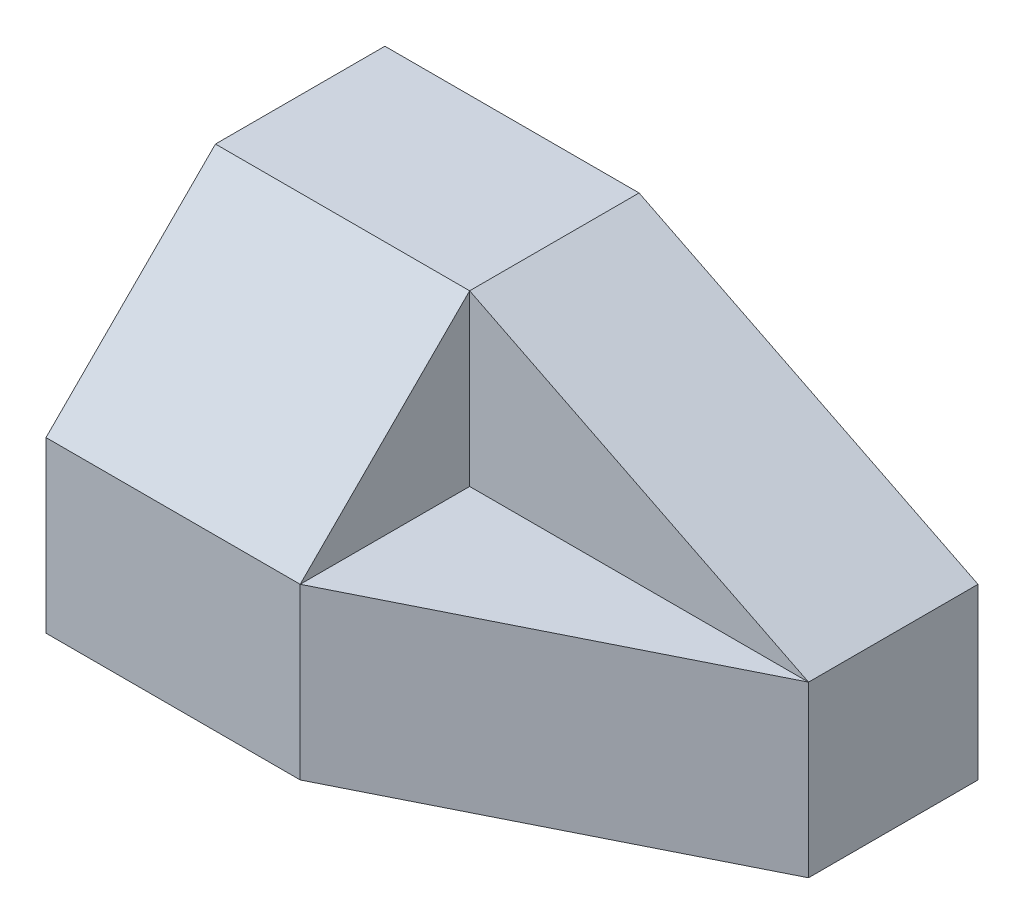
ISO-10303-21;
HEADER;
FILE_DESCRIPTION(('STEP AP214'),'2;1');
FILE_NAME('part.step','',(''),(''),'','','');
FILE_SCHEMA(('AUTOMOTIVE_DESIGN { 1 0 10303 214 1 1 1 1 }'));
ENDSEC;
DATA;
#1=APPLICATION_CONTEXT('core data for automotive mechanical design processes');
#2=APPLICATION_PROTOCOL_DEFINITION('international standard','automotive_design',2000,#1);
#3=PRODUCT_CONTEXT('',#1,'mechanical');
#4=PRODUCT('Part','Part','',(#3));
#5=PRODUCT_RELATED_PRODUCT_CATEGORY('part','',(#4));
#6=PRODUCT_DEFINITION_FORMATION('','',#4);
#7=PRODUCT_DEFINITION_CONTEXT('part definition',#1,'design');
#8=PRODUCT_DEFINITION('design','',#6,#7);
#9=PRODUCT_DEFINITION_SHAPE('','',#8);
#10=(LENGTH_UNIT() NAMED_UNIT(*) SI_UNIT(.MILLI.,.METRE.));
#11=(NAMED_UNIT(*) PLANE_ANGLE_UNIT() SI_UNIT($,.RADIAN.));
#12=(NAMED_UNIT(*) SI_UNIT($,.STERADIAN.) SOLID_ANGLE_UNIT());
#13=UNCERTAINTY_MEASURE_WITH_UNIT(LENGTH_MEASURE(1.E-05),#10,'distance_accuracy_value','');
#14=(GEOMETRIC_REPRESENTATION_CONTEXT(3) GLOBAL_UNCERTAINTY_ASSIGNED_CONTEXT((#13)) GLOBAL_UNIT_ASSIGNED_CONTEXT((#10,
#11,#12)) REPRESENTATION_CONTEXT('',''));
#15=CARTESIAN_POINT('',(0.,0.,0.));
#16=DIRECTION('',(0.,0.,1.));
#17=DIRECTION('',(1.,0.,0.));
#18=AXIS2_PLACEMENT_3D('',#15,#16,#17);
#19=CARTESIAN_POINT('',(177.8,101.6,0.));
#20=DIRECTION('',(-1.,0.,0.));
#21=DIRECTION('',(0.,0.,1.));
#22=AXIS2_PLACEMENT_3D('',#19,#20,#21);
#23=PLANE('',#22);
#24=DIRECTION('',(0.,-1.,0.));
#25=VECTOR('',#24,1.);
#26=CARTESIAN_POINT('',(177.8,101.6,-101.6));
#27=LINE('',#26,#25);
#28=CARTESIAN_POINT('',(177.8,50.8,-101.6));
#29=VERTEX_POINT('',#28);
#30=CARTESIAN_POINT('',(177.8,0.,-101.6));
#31=VERTEX_POINT('',#30);
#32=EDGE_CURVE('E41',#29,#31,#27,.T.);
#33=ORIENTED_EDGE('',*,*,#32,.F.);
#34=DIRECTION('',(0.,0.,1.));
#35=VECTOR('',#34,1.);
#36=CARTESIAN_POINT('',(177.8,50.8,-101.6));
#37=LINE('',#36,#35);
#38=CARTESIAN_POINT('',(177.8,50.8,-50.8));
#39=VERTEX_POINT('',#38);
#40=EDGE_CURVE('E143',#29,#39,#37,.T.);
#41=ORIENTED_EDGE('',*,*,#40,.T.);
#42=DIRECTION('',(0.,-1.,0.));
#43=VECTOR('',#42,1.);
#44=CARTESIAN_POINT('',(177.8,50.8,-50.8));
#45=LINE('',#44,#43);
#46=CARTESIAN_POINT('',(177.8,0.,-50.8));
#47=VERTEX_POINT('',#46);
#48=EDGE_CURVE('E87',#39,#47,#45,.T.);
#49=ORIENTED_EDGE('',*,*,#48,.T.);
#50=DIRECTION('',(0.,0.,-1.));
#51=VECTOR('',#50,1.);
#52=CARTESIAN_POINT('',(177.8,0.,0.));
#53=LINE('',#52,#51);
#54=EDGE_CURVE('E84',#47,#31,#53,.T.);
#55=ORIENTED_EDGE('',*,*,#54,.T.);
#56=EDGE_LOOP('',(#33,#41,#49,#55));
#57=FACE_BOUND('',#56,.T.);
#58=ADVANCED_FACE('F33',(#57),#23,.F.);
#59=CARTESIAN_POINT('',(0.,101.6,0.));
#60=DIRECTION('',(0.,-1.,0.));
#61=DIRECTION('',(0.,0.,-1.));
#62=AXIS2_PLACEMENT_3D('',#59,#60,#61);
#63=PLANE('',#62);
#64=DIRECTION('',(1.,0.,0.));
#65=VECTOR('',#64,1.);
#66=CARTESIAN_POINT('',(-285.75,101.6,-50.8));
#67=LINE('',#66,#65);
#68=CARTESIAN_POINT('',(0.,101.6,-50.8));
#69=VERTEX_POINT('',#68);
#70=CARTESIAN_POINT('',(76.2,101.6,-50.8));
#71=VERTEX_POINT('',#70);
#72=EDGE_CURVE('E106',#69,#71,#67,.T.);
#73=ORIENTED_EDGE('',*,*,#72,.T.);
#74=DIRECTION('',(0.,0.,1.));
#75=VECTOR('',#74,1.);
#76=CARTESIAN_POINT('',(76.2,101.6,-101.6));
#77=LINE('',#76,#75);
#78=CARTESIAN_POINT('',(76.2,101.6,-101.6));
#79=VERTEX_POINT('',#78);
#80=EDGE_CURVE('E141',#79,#71,#77,.T.);
#81=ORIENTED_EDGE('',*,*,#80,.F.);
#82=DIRECTION('',(-1.,0.,0.));
#83=VECTOR('',#82,1.);
#84=CARTESIAN_POINT('',(0.,101.6,-101.6));
#85=LINE('',#84,#83);
#86=CARTESIAN_POINT('',(0.,101.6,-101.6));
#87=VERTEX_POINT('',#86);
#88=EDGE_CURVE('E57',#79,#87,#85,.T.);
#89=ORIENTED_EDGE('',*,*,#88,.T.);
#90=DIRECTION('',(0.,0.,1.));
#91=VECTOR('',#90,1.);
#92=CARTESIAN_POINT('',(0.,101.6,0.));
#93=LINE('',#92,#91);
#94=EDGE_CURVE('E96',#87,#69,#93,.T.);
#95=ORIENTED_EDGE('',*,*,#94,.T.);
#96=EDGE_LOOP('',(#73,#81,#89,#95));
#97=FACE_BOUND('',#96,.T.);
#98=ADVANCED_FACE('F146',(#97),#63,.F.);
#99=CARTESIAN_POINT('',(0.,101.6,0.));
#100=DIRECTION('',(0.,0.,-1.));
#101=DIRECTION('',(-1.,0.,0.));
#102=AXIS2_PLACEMENT_3D('',#99,#100,#101);
#103=PLANE('',#102);
#104=DIRECTION('',(0.,-1.,0.));
#105=VECTOR('',#104,1.);
#106=CARTESIAN_POINT('',(76.2,50.8,0.));
#107=LINE('',#106,#105);
#108=CARTESIAN_POINT('',(76.2,50.8,0.));
#109=VERTEX_POINT('',#108);
#110=CARTESIAN_POINT('',(76.2,0.,0.));
#111=VERTEX_POINT('',#110);
#112=EDGE_CURVE('E48',#109,#111,#107,.T.);
#113=ORIENTED_EDGE('',*,*,#112,.F.);
#114=DIRECTION('',(1.,0.,0.));
#115=VECTOR('',#114,1.);
#116=CARTESIAN_POINT('',(-285.75,50.8,0.));
#117=LINE('',#116,#115);
#118=CARTESIAN_POINT('',(0.,50.8,0.));
#119=VERTEX_POINT('',#118);
#120=EDGE_CURVE('E168',#119,#109,#117,.T.);
#121=ORIENTED_EDGE('',*,*,#120,.F.);
#122=DIRECTION('',(0.,-1.,0.));
#123=VECTOR('',#122,1.);
#124=CARTESIAN_POINT('',(0.,101.6,0.));
#125=LINE('',#124,#123);
#126=CARTESIAN_POINT('',(0.,0.,0.));
#127=VERTEX_POINT('',#126);
#128=EDGE_CURVE('E11',#119,#127,#125,.T.);
#129=ORIENTED_EDGE('',*,*,#128,.T.);
#130=DIRECTION('',(1.,0.,0.));
#131=VECTOR('',#130,1.);
#132=CARTESIAN_POINT('',(0.,0.,0.));
#133=LINE('',#132,#131);
#134=EDGE_CURVE('E89',#127,#111,#133,.T.);
#135=ORIENTED_EDGE('',*,*,#134,.T.);
#136=EDGE_LOOP('',(#113,#121,#129,#135));
#137=FACE_BOUND('',#136,.T.);
#138=ADVANCED_FACE('F109',(#137),#103,.F.);
#139=CARTESIAN_POINT('',(0.,0.,0.));
#140=DIRECTION('',(0.,-1.,0.));
#141=DIRECTION('',(0.,0.,-1.));
#142=AXIS2_PLACEMENT_3D('',#139,#140,#141);
#143=PLANE('',#142);
#144=ORIENTED_EDGE('',*,*,#54,.F.);
#145=DIRECTION('',(-0.894427190999916,0.,0.447213595499958));
#146=VECTOR('',#145,1.);
#147=CARTESIAN_POINT('',(76.2,0.,0.));
#148=LINE('',#147,#146);
#149=EDGE_CURVE('E114',#47,#111,#148,.T.);
#150=ORIENTED_EDGE('',*,*,#149,.T.);
#151=ORIENTED_EDGE('',*,*,#134,.F.);
#152=DIRECTION('',(0.,0.,1.));
#153=VECTOR('',#152,1.);
#154=CARTESIAN_POINT('',(0.,0.,0.));
#155=LINE('',#154,#153);
#156=CARTESIAN_POINT('',(0.,0.,-101.6));
#157=VERTEX_POINT('',#156);
#158=EDGE_CURVE('E95',#157,#127,#155,.T.);
#159=ORIENTED_EDGE('',*,*,#158,.F.);
#160=DIRECTION('',(-1.,0.,0.));
#161=VECTOR('',#160,1.);
#162=CARTESIAN_POINT('',(0.,0.,-101.6));
#163=LINE('',#162,#161);
#164=EDGE_CURVE('E74',#31,#157,#163,.T.);
#165=ORIENTED_EDGE('',*,*,#164,.F.);
#166=EDGE_LOOP('',(#144,#150,#151,#159,#165));
#167=FACE_BOUND('',#166,.T.);
#168=ADVANCED_FACE('F92',(#167),#143,.T.);
#169=CARTESIAN_POINT('',(0.,101.6,0.));
#170=DIRECTION('',(1.,0.,0.));
#171=DIRECTION('',(0.,0.,-1.));
#172=AXIS2_PLACEMENT_3D('',#169,#170,#171);
#173=PLANE('',#172);
#174=ORIENTED_EDGE('',*,*,#128,.F.);
#175=DIRECTION('',(0.,-0.707106781186548,0.707106781186548));
#176=VECTOR('',#175,1.);
#177=CARTESIAN_POINT('',(0.,50.8,0.));
#178=LINE('',#177,#176);
#179=EDGE_CURVE('E118',#69,#119,#178,.T.);
#180=ORIENTED_EDGE('',*,*,#179,.F.);
#181=ORIENTED_EDGE('',*,*,#94,.F.);
#182=DIRECTION('',(0.,-1.,0.));
#183=VECTOR('',#182,1.);
#184=CARTESIAN_POINT('',(0.,101.6,-101.6));
#185=LINE('',#184,#183);
#186=EDGE_CURVE('E81',#87,#157,#185,.T.);
#187=ORIENTED_EDGE('',*,*,#186,.T.);
#188=ORIENTED_EDGE('',*,*,#158,.T.);
#189=EDGE_LOOP('',(#174,#180,#181,#187,#188));
#190=FACE_BOUND('',#189,.T.);
#191=ADVANCED_FACE('F35',(#190),#173,.F.);
#192=CARTESIAN_POINT('',(0.,101.6,-101.6));
#193=DIRECTION('',(0.,0.,1.));
#194=DIRECTION('',(1.,0.,0.));
#195=AXIS2_PLACEMENT_3D('',#192,#193,#194);
#196=PLANE('',#195);
#197=ORIENTED_EDGE('',*,*,#88,.F.);
#198=DIRECTION('',(0.894427190999916,-0.447213595499958,0.));
#199=VECTOR('',#198,1.);
#200=CARTESIAN_POINT('',(177.8,50.8,-101.6));
#201=LINE('',#200,#199);
#202=EDGE_CURVE('E78',#79,#29,#201,.T.);
#203=ORIENTED_EDGE('',*,*,#202,.T.);
#204=ORIENTED_EDGE('',*,*,#32,.T.);
#205=ORIENTED_EDGE('',*,*,#164,.T.);
#206=ORIENTED_EDGE('',*,*,#186,.F.);
#207=EDGE_LOOP('',(#197,#203,#204,#205,#206));
#208=FACE_BOUND('',#207,.T.);
#209=ADVANCED_FACE('F72',(#208),#196,.F.);
#210=CARTESIAN_POINT('',(-285.75,50.8,0.));
#211=DIRECTION('',(0.,-0.707106781186548,-0.707106781186548));
#212=DIRECTION('',(0.,0.707106781186548,-0.707106781186548));
#213=AXIS2_PLACEMENT_3D('',#210,#211,#212);
#214=PLANE('',#213);
#215=ORIENTED_EDGE('',*,*,#179,.T.);
#216=ORIENTED_EDGE('',*,*,#120,.T.);
#217=DIRECTION('',(0.,-0.707106781186548,0.707106781186548));
#218=VECTOR('',#217,1.);
#219=CARTESIAN_POINT('',(76.2,50.8,0.));
#220=LINE('',#219,#218);
#221=EDGE_CURVE('E165',#71,#109,#220,.T.);
#222=ORIENTED_EDGE('',*,*,#221,.F.);
#223=ORIENTED_EDGE('',*,*,#72,.F.);
#224=EDGE_LOOP('',(#215,#216,#222,#223));
#225=FACE_BOUND('',#224,.T.);
#226=ADVANCED_FACE('F170',(#225),#214,.F.);
#227=CARTESIAN_POINT('',(76.2,50.8,0.));
#228=DIRECTION('',(0.447213595499958,0.,0.894427190999916));
#229=DIRECTION('',(0.894427190999916,0.,-0.447213595499958));
#230=AXIS2_PLACEMENT_3D('',#227,#228,#229);
#231=PLANE('',#230);
#232=DIRECTION('',(0.894427190999916,0.,-0.447213595499958));
#233=VECTOR('',#232,1.);
#234=CARTESIAN_POINT('',(76.2,50.8,0.));
#235=LINE('',#234,#233);
#236=EDGE_CURVE('E148',#109,#39,#235,.T.);
#237=ORIENTED_EDGE('',*,*,#236,.F.);
#238=ORIENTED_EDGE('',*,*,#112,.T.);
#239=ORIENTED_EDGE('',*,*,#149,.F.);
#240=ORIENTED_EDGE('',*,*,#48,.F.);
#241=EDGE_LOOP('',(#237,#238,#239,#240));
#242=FACE_BOUND('',#241,.T.);
#243=ADVANCED_FACE('F174',(#242),#231,.T.);
#244=CARTESIAN_POINT('',(76.2,50.8,-50.8));
#245=DIRECTION('',(-1.,0.,0.));
#246=DIRECTION('',(0.,0.,1.));
#247=AXIS2_PLACEMENT_3D('',#244,#245,#246);
#248=PLANE('',#247);
#249=DIRECTION('',(0.,0.,1.));
#250=VECTOR('',#249,1.);
#251=CARTESIAN_POINT('',(76.2,50.8,-50.8));
#252=LINE('',#251,#250);
#253=CARTESIAN_POINT('',(76.2,50.8,-50.8));
#254=VERTEX_POINT('',#253);
#255=EDGE_CURVE('E157',#254,#109,#252,.T.);
#256=ORIENTED_EDGE('',*,*,#255,.F.);
#257=DIRECTION('',(0.,1.,0.));
#258=VECTOR('',#257,1.);
#259=CARTESIAN_POINT('',(76.2,50.8,-50.8));
#260=LINE('',#259,#258);
#261=EDGE_CURVE('E159',#254,#71,#260,.T.);
#262=ORIENTED_EDGE('',*,*,#261,.T.);
#263=ORIENTED_EDGE('',*,*,#221,.T.);
#264=EDGE_LOOP('',(#256,#262,#263));
#265=FACE_BOUND('',#264,.T.);
#266=ADVANCED_FACE('F173',(#265),#248,.F.);
#267=CARTESIAN_POINT('',(177.8,50.8,-50.8));
#268=DIRECTION('',(0.,0.,-1.));
#269=DIRECTION('',(-1.,0.,0.));
#270=AXIS2_PLACEMENT_3D('',#267,#268,#269);
#271=PLANE('',#270);
#272=DIRECTION('',(-1.,0.,0.));
#273=VECTOR('',#272,1.);
#274=CARTESIAN_POINT('',(177.8,50.8,-50.8));
#275=LINE('',#274,#273);
#276=EDGE_CURVE('E154',#39,#254,#275,.T.);
#277=ORIENTED_EDGE('',*,*,#276,.F.);
#278=DIRECTION('',(0.894427190999916,-0.447213595499958,0.));
#279=VECTOR('',#278,1.);
#280=CARTESIAN_POINT('',(177.8,50.8,-50.8));
#281=LINE('',#280,#279);
#282=EDGE_CURVE('E144',#71,#39,#281,.T.);
#283=ORIENTED_EDGE('',*,*,#282,.F.);
#284=ORIENTED_EDGE('',*,*,#261,.F.);
#285=EDGE_LOOP('',(#277,#283,#284));
#286=FACE_BOUND('',#285,.T.);
#287=ADVANCED_FACE('F179',(#286),#271,.F.);
#288=CARTESIAN_POINT('',(0.,50.8,0.));
#289=DIRECTION('',(0.,-1.,0.));
#290=DIRECTION('',(0.,0.,-1.));
#291=AXIS2_PLACEMENT_3D('',#288,#289,#290);
#292=PLANE('',#291);
#293=ORIENTED_EDGE('',*,*,#236,.T.);
#294=ORIENTED_EDGE('',*,*,#276,.T.);
#295=ORIENTED_EDGE('',*,*,#255,.T.);
#296=EDGE_LOOP('',(#293,#294,#295));
#297=FACE_BOUND('',#296,.T.);
#298=ADVANCED_FACE('F176',(#297),#292,.F.);
#299=CARTESIAN_POINT('',(177.8,50.8,-101.6));
#300=DIRECTION('',(-0.447213595499958,-0.894427190999916,0.));
#301=DIRECTION('',(0.894427190999916,-0.447213595499958,0.));
#302=AXIS2_PLACEMENT_3D('',#299,#300,#301);
#303=PLANE('',#302);
#304=ORIENTED_EDGE('',*,*,#282,.T.);
#305=ORIENTED_EDGE('',*,*,#40,.F.);
#306=ORIENTED_EDGE('',*,*,#202,.F.);
#307=ORIENTED_EDGE('',*,*,#80,.T.);
#308=EDGE_LOOP('',(#304,#305,#306,#307));
#309=FACE_BOUND('',#308,.T.);
#310=ADVANCED_FACE('F140',(#309),#303,.F.);
#311=CLOSED_SHELL('',(#58,#98,#138,#168,#191,#209,#226,#243,#266,#287,#298,#310));
#312=MANIFOLD_SOLID_BREP('B2',#311);
#313=ADVANCED_BREP_SHAPE_REPRESENTATION('',(#18,#312),#14);
#314=SHAPE_DEFINITION_REPRESENTATION(#9,#313);
ENDSEC;
END-ISO-10303-21;
